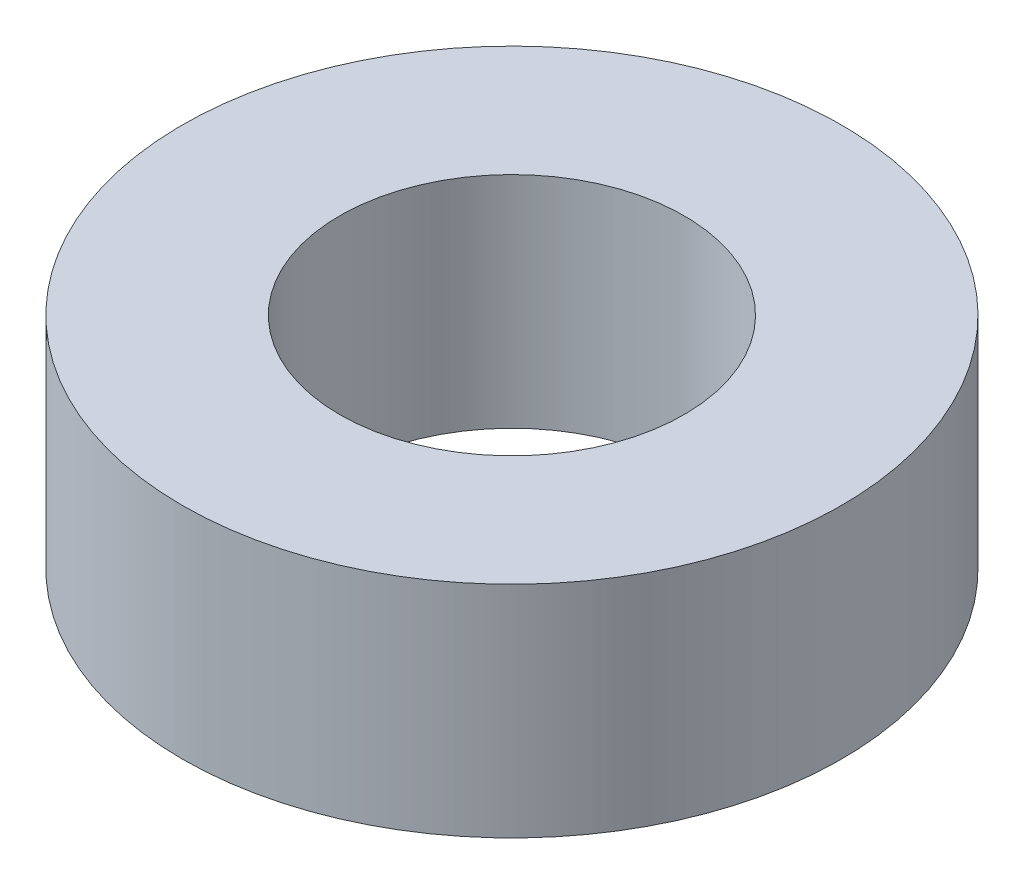
ISO-10303-21;
HEADER;
FILE_DESCRIPTION(('STEP AP214'),'2;1');
FILE_NAME('part.step','',(''),(''),'','','');
FILE_SCHEMA(('AUTOMOTIVE_DESIGN { 1 0 10303 214 1 1 1 1 }'));
ENDSEC;
DATA;
#1=APPLICATION_CONTEXT('core data for automotive mechanical design processes');
#2=APPLICATION_PROTOCOL_DEFINITION('international standard','automotive_design',2000,#1);
#3=PRODUCT_CONTEXT('',#1,'mechanical');
#4=PRODUCT('Part','Part','',(#3));
#5=PRODUCT_RELATED_PRODUCT_CATEGORY('part','',(#4));
#6=PRODUCT_DEFINITION_FORMATION('','',#4);
#7=PRODUCT_DEFINITION_CONTEXT('part definition',#1,'design');
#8=PRODUCT_DEFINITION('design','',#6,#7);
#9=PRODUCT_DEFINITION_SHAPE('','',#8);
#10=(LENGTH_UNIT() NAMED_UNIT(*) SI_UNIT(.MILLI.,.METRE.));
#11=(NAMED_UNIT(*) PLANE_ANGLE_UNIT() SI_UNIT($,.RADIAN.));
#12=(NAMED_UNIT(*) SI_UNIT($,.STERADIAN.) SOLID_ANGLE_UNIT());
#13=UNCERTAINTY_MEASURE_WITH_UNIT(LENGTH_MEASURE(1.E-05),#10,'distance_accuracy_value','');
#14=(GEOMETRIC_REPRESENTATION_CONTEXT(3) GLOBAL_UNCERTAINTY_ASSIGNED_CONTEXT((#13)) GLOBAL_UNIT_ASSIGNED_CONTEXT((#10,
#11,#12)) REPRESENTATION_CONTEXT('',''));
#15=CARTESIAN_POINT('',(0.,0.,0.));
#16=DIRECTION('',(0.,0.,1.));
#17=DIRECTION('',(1.,0.,0.));
#18=AXIS2_PLACEMENT_3D('',#15,#16,#17);
#19=CARTESIAN_POINT('',(0.,3.175,0.));
#20=DIRECTION('',(0.,1.,0.));
#21=DIRECTION('',(0.,0.,1.));
#22=AXIS2_PLACEMENT_3D('',#19,#20,#21);
#23=PLANE('',#22);
#24=CARTESIAN_POINT('',(0.,3.175,0.));
#25=DIRECTION('',(0.,1.,0.));
#26=DIRECTION('',(0.,0.,1.));
#27=AXIS2_PLACEMENT_3D('',#24,#25,#26);
#28=CIRCLE('',#27,4.7625);
#29=CARTESIAN_POINT('',(0.,3.175,4.7625));
#30=VERTEX_POINT('',#29);
#31=EDGE_CURVE('E10',#30,#30,#28,.T.);
#32=ORIENTED_EDGE('',*,*,#31,.T.);
#33=EDGE_LOOP('',(#32));
#34=FACE_BOUND('',#33,.T.);
#35=CARTESIAN_POINT('',(0.,3.175,0.));
#36=DIRECTION('',(0.,1.,0.));
#37=DIRECTION('',(0.,0.,1.));
#38=AXIS2_PLACEMENT_3D('',#35,#36,#37);
#39=CIRCLE('',#38,2.4892);
#40=CARTESIAN_POINT('',(0.,3.175,2.4892));
#41=VERTEX_POINT('',#40);
#42=EDGE_CURVE('E41',#41,#41,#39,.T.);
#43=ORIENTED_EDGE('',*,*,#42,.F.);
#44=EDGE_LOOP('',(#43));
#45=FACE_BOUND('',#44,.T.);
#46=ADVANCED_FACE('F30',(#34,#45),#23,.T.);
#47=CARTESIAN_POINT('',(0.,0.,0.));
#48=DIRECTION('',(0.,1.,0.));
#49=DIRECTION('',(0.,0.,1.));
#50=AXIS2_PLACEMENT_3D('',#47,#48,#49);
#51=PLANE('',#50);
#52=CARTESIAN_POINT('',(0.,0.,0.));
#53=DIRECTION('',(0.,1.,0.));
#54=DIRECTION('',(0.,0.,1.));
#55=AXIS2_PLACEMENT_3D('',#52,#53,#54);
#56=CIRCLE('',#55,4.7625);
#57=CARTESIAN_POINT('',(0.,0.,4.7625));
#58=VERTEX_POINT('',#57);
#59=EDGE_CURVE('E34',#58,#58,#56,.T.);
#60=ORIENTED_EDGE('',*,*,#59,.F.);
#61=EDGE_LOOP('',(#60));
#62=FACE_BOUND('',#61,.T.);
#63=CARTESIAN_POINT('',(0.,0.,0.));
#64=DIRECTION('',(0.,1.,0.));
#65=DIRECTION('',(0.,0.,1.));
#66=AXIS2_PLACEMENT_3D('',#63,#64,#65);
#67=CIRCLE('',#66,2.4892);
#68=CARTESIAN_POINT('',(0.,0.,2.4892));
#69=VERTEX_POINT('',#68);
#70=EDGE_CURVE('E43',#69,#69,#67,.T.);
#71=ORIENTED_EDGE('',*,*,#70,.T.);
#72=EDGE_LOOP('',(#71));
#73=FACE_BOUND('',#72,.T.);
#74=ADVANCED_FACE('F53',(#62,#73),#51,.F.);
#75=CARTESIAN_POINT('',(0.,3.175,0.));
#76=DIRECTION('',(0.,-1.,0.));
#77=DIRECTION('',(0.,0.,-1.));
#78=AXIS2_PLACEMENT_3D('',#75,#76,#77);
#79=CYLINDRICAL_SURFACE('',#78,4.7625);
#80=ORIENTED_EDGE('',*,*,#31,.F.);
#81=EDGE_LOOP('',(#80));
#82=FACE_BOUND('',#81,.T.);
#83=ORIENTED_EDGE('',*,*,#59,.T.);
#84=EDGE_LOOP('',(#83));
#85=FACE_BOUND('',#84,.T.);
#86=ADVANCED_FACE('F32',(#82,#85),#79,.T.);
#87=CARTESIAN_POINT('',(0.,3.175,0.));
#88=DIRECTION('',(0.,-1.,0.));
#89=DIRECTION('',(0.,0.,-1.));
#90=AXIS2_PLACEMENT_3D('',#87,#88,#89);
#91=CYLINDRICAL_SURFACE('',#90,2.4892);
#92=ORIENTED_EDGE('',*,*,#42,.T.);
#93=EDGE_LOOP('',(#92));
#94=FACE_BOUND('',#93,.T.);
#95=ORIENTED_EDGE('',*,*,#70,.F.);
#96=EDGE_LOOP('',(#95));
#97=FACE_BOUND('',#96,.T.);
#98=ADVANCED_FACE('F49',(#94,#97),#91,.F.);
#99=CLOSED_SHELL('',(#46,#74,#86,#98));
#100=MANIFOLD_SOLID_BREP('B2',#99);
#101=ADVANCED_BREP_SHAPE_REPRESENTATION('',(#18,#100),#14);
#102=SHAPE_DEFINITION_REPRESENTATION(#9,#101);
ENDSEC;
END-ISO-10303-21;
